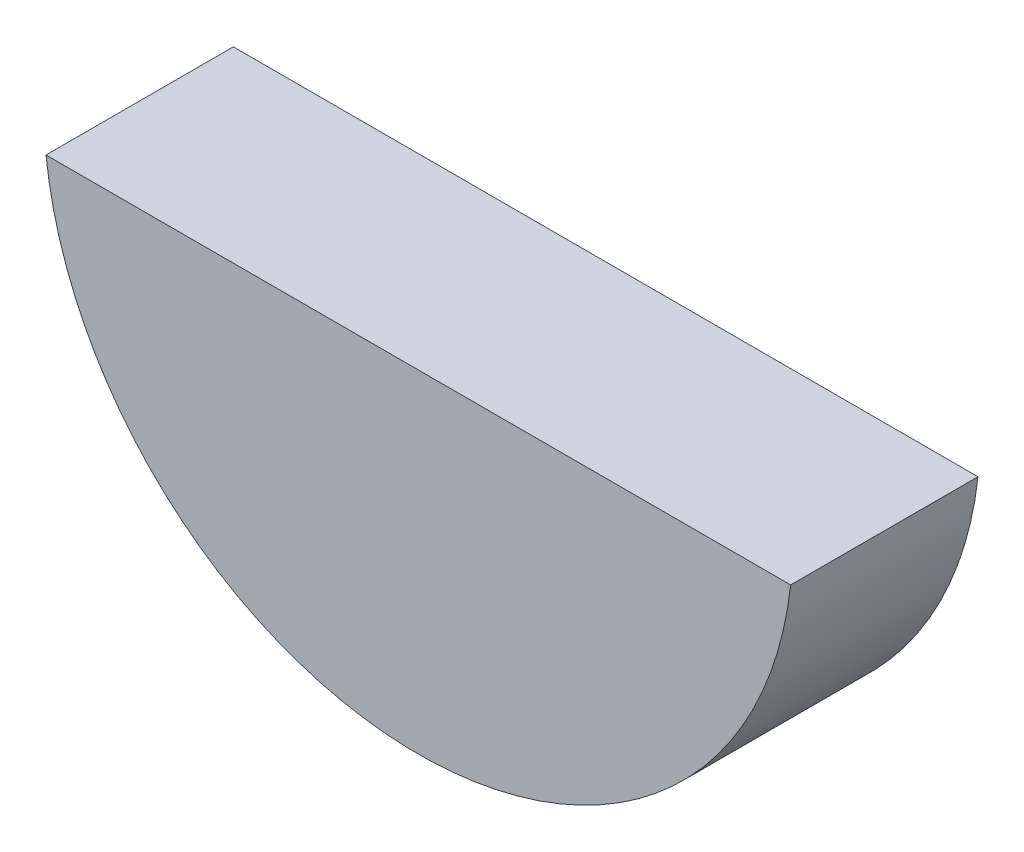
ISO-10303-21;
HEADER;
FILE_DESCRIPTION(('STEP AP214'),'2;1');
FILE_NAME('part.step','',(''),(''),'','','');
FILE_SCHEMA(('AUTOMOTIVE_DESIGN { 1 0 10303 214 1 1 1 1 }'));
ENDSEC;
DATA;
#1=APPLICATION_CONTEXT('core data for automotive mechanical design processes');
#2=APPLICATION_PROTOCOL_DEFINITION('international standard','automotive_design',2000,#1);
#3=PRODUCT_CONTEXT('',#1,'mechanical');
#4=PRODUCT('Part','Part','',(#3));
#5=PRODUCT_RELATED_PRODUCT_CATEGORY('part','',(#4));
#6=PRODUCT_DEFINITION_FORMATION('','',#4);
#7=PRODUCT_DEFINITION_CONTEXT('part definition',#1,'design');
#8=PRODUCT_DEFINITION('design','',#6,#7);
#9=PRODUCT_DEFINITION_SHAPE('','',#8);
#10=(LENGTH_UNIT() NAMED_UNIT(*) SI_UNIT(.MILLI.,.METRE.));
#11=(NAMED_UNIT(*) PLANE_ANGLE_UNIT() SI_UNIT($,.RADIAN.));
#12=(NAMED_UNIT(*) SI_UNIT($,.STERADIAN.) SOLID_ANGLE_UNIT());
#13=UNCERTAINTY_MEASURE_WITH_UNIT(LENGTH_MEASURE(1.E-05),#10,'distance_accuracy_value','');
#14=(GEOMETRIC_REPRESENTATION_CONTEXT(3) GLOBAL_UNCERTAINTY_ASSIGNED_CONTEXT((#13)) GLOBAL_UNIT_ASSIGNED_CONTEXT((#10,
#11,#12)) REPRESENTATION_CONTEXT('',''));
#15=CARTESIAN_POINT('',(0.,0.,0.));
#16=DIRECTION('',(0.,0.,1.));
#17=DIRECTION('',(1.,0.,0.));
#18=AXIS2_PLACEMENT_3D('',#15,#16,#17);
#19=CARTESIAN_POINT('',(0.,0.,1.5875));
#20=DIRECTION('',(0.,0.,-1.));
#21=DIRECTION('',(-1.,0.,0.));
#22=AXIS2_PLACEMENT_3D('',#19,#20,#21);
#23=CYLINDRICAL_SURFACE('',#22,3.175);
#24=CARTESIAN_POINT('',(0.,0.,1.5875));
#25=DIRECTION('',(0.,0.,1.));
#26=DIRECTION('',(1.,0.,0.));
#27=AXIS2_PLACEMENT_3D('',#24,#25,#26);
#28=CIRCLE('',#27,3.175);
#29=CARTESIAN_POINT('',(-3.15507019716389,-0.355185938584634,1.5875));
#30=VERTEX_POINT('',#29);
#31=CARTESIAN_POINT('',(3.15507019716389,-0.355185938584634,1.5875));
#32=VERTEX_POINT('',#31);
#33=EDGE_CURVE('E11',#30,#32,#28,.T.);
#34=ORIENTED_EDGE('',*,*,#33,.F.);
#35=DIRECTION('',(0.,0.,1.));
#36=VECTOR('',#35,1.);
#37=CARTESIAN_POINT('',(-3.15507019716389,-0.355185938584634,0.));
#38=LINE('',#37,#36);
#39=CARTESIAN_POINT('',(-3.15507019716389,-0.355185938584634,0.));
#40=VERTEX_POINT('',#39);
#41=EDGE_CURVE('E57',#40,#30,#38,.T.);
#42=ORIENTED_EDGE('',*,*,#41,.F.);
#43=CARTESIAN_POINT('',(0.,0.,0.));
#44=DIRECTION('',(0.,0.,1.));
#45=DIRECTION('',(1.,0.,0.));
#46=AXIS2_PLACEMENT_3D('',#43,#44,#45);
#47=CIRCLE('',#46,3.175);
#48=CARTESIAN_POINT('',(3.15507019716389,-0.355185938584634,0.));
#49=VERTEX_POINT('',#48);
#50=EDGE_CURVE('E37',#40,#49,#47,.T.);
#51=ORIENTED_EDGE('',*,*,#50,.T.);
#52=DIRECTION('',(0.,0.,1.));
#53=VECTOR('',#52,1.);
#54=CARTESIAN_POINT('',(3.15507019716389,-0.355185938584634,0.));
#55=LINE('',#54,#53);
#56=EDGE_CURVE('E48',#49,#32,#55,.T.);
#57=ORIENTED_EDGE('',*,*,#56,.T.);
#58=EDGE_LOOP('',(#34,#42,#51,#57));
#59=FACE_BOUND('',#58,.T.);
#60=ADVANCED_FACE('F34',(#59),#23,.T.);
#61=CARTESIAN_POINT('',(0.,0.,1.5875));
#62=DIRECTION('',(0.,0.,1.));
#63=DIRECTION('',(1.,0.,0.));
#64=AXIS2_PLACEMENT_3D('',#61,#62,#63);
#65=PLANE('',#64);
#66=DIRECTION('',(1.,0.,0.));
#67=VECTOR('',#66,1.);
#68=CARTESIAN_POINT('',(-3.15507019716389,-0.355185938584634,1.5875));
#69=LINE('',#68,#67);
#70=EDGE_CURVE('E60',#30,#32,#69,.T.);
#71=ORIENTED_EDGE('',*,*,#70,.F.);
#72=ORIENTED_EDGE('',*,*,#33,.T.);
#73=EDGE_LOOP('',(#71,#72));
#74=FACE_BOUND('',#73,.T.);
#75=ADVANCED_FACE('F67',(#74),#65,.T.);
#76=CARTESIAN_POINT('',(0.,0.,0.));
#77=DIRECTION('',(0.,0.,1.));
#78=DIRECTION('',(1.,0.,0.));
#79=AXIS2_PLACEMENT_3D('',#76,#77,#78);
#80=PLANE('',#79);
#81=ORIENTED_EDGE('',*,*,#50,.F.);
#82=DIRECTION('',(1.,0.,0.));
#83=VECTOR('',#82,1.);
#84=CARTESIAN_POINT('',(-3.15507019716389,-0.355185938584634,0.));
#85=LINE('',#84,#83);
#86=EDGE_CURVE('E53',#40,#49,#85,.T.);
#87=ORIENTED_EDGE('',*,*,#86,.T.);
#88=EDGE_LOOP('',(#81,#87));
#89=FACE_BOUND('',#88,.T.);
#90=ADVANCED_FACE('F72',(#89),#80,.F.);
#91=CARTESIAN_POINT('',(-3.15507019716389,-0.355185938584634,0.));
#92=DIRECTION('',(0.,-1.,0.));
#93=DIRECTION('',(0.,0.,-1.));
#94=AXIS2_PLACEMENT_3D('',#91,#92,#93);
#95=PLANE('',#94);
#96=ORIENTED_EDGE('',*,*,#70,.T.);
#97=ORIENTED_EDGE('',*,*,#56,.F.);
#98=ORIENTED_EDGE('',*,*,#86,.F.);
#99=ORIENTED_EDGE('',*,*,#41,.T.);
#100=EDGE_LOOP('',(#96,#97,#98,#99));
#101=FACE_BOUND('',#100,.T.);
#102=ADVANCED_FACE('F59',(#101),#95,.F.);
#103=CLOSED_SHELL('',(#60,#75,#90,#102));
#104=MANIFOLD_SOLID_BREP('B2',#103);
#105=ADVANCED_BREP_SHAPE_REPRESENTATION('',(#18,#104),#14);
#106=SHAPE_DEFINITION_REPRESENTATION(#9,#105);
ENDSEC;
END-ISO-10303-21;
